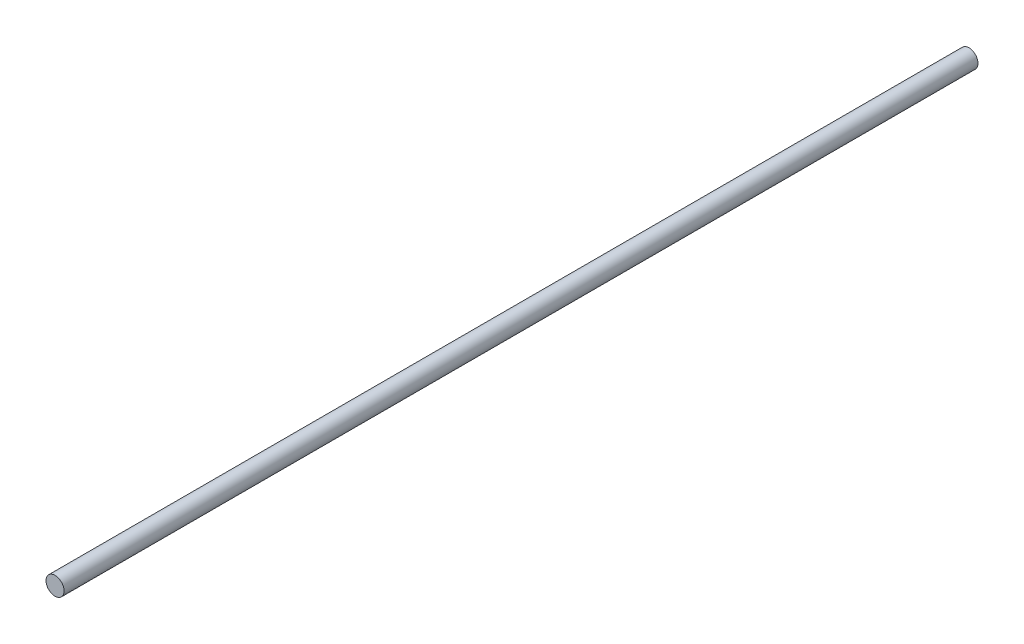
ISO-10303-21;
HEADER;
FILE_DESCRIPTION(('STEP AP214'),'2;1');
FILE_NAME('part.step','',(''),(''),'','','');
FILE_SCHEMA(('AUTOMOTIVE_DESIGN { 1 0 10303 214 1 1 1 1 }'));
ENDSEC;
DATA;
#1=APPLICATION_CONTEXT('core data for automotive mechanical design processes');
#2=APPLICATION_PROTOCOL_DEFINITION('international standard','automotive_design',2000,#1);
#3=PRODUCT_CONTEXT('',#1,'mechanical');
#4=PRODUCT('Part','Part','',(#3));
#5=PRODUCT_RELATED_PRODUCT_CATEGORY('part','',(#4));
#6=PRODUCT_DEFINITION_FORMATION('','',#4);
#7=PRODUCT_DEFINITION_CONTEXT('part definition',#1,'design');
#8=PRODUCT_DEFINITION('design','',#6,#7);
#9=PRODUCT_DEFINITION_SHAPE('','',#8);
#10=(LENGTH_UNIT() NAMED_UNIT(*) SI_UNIT(.MILLI.,.METRE.));
#11=(NAMED_UNIT(*) PLANE_ANGLE_UNIT() SI_UNIT($,.RADIAN.));
#12=(NAMED_UNIT(*) SI_UNIT($,.STERADIAN.) SOLID_ANGLE_UNIT());
#13=UNCERTAINTY_MEASURE_WITH_UNIT(LENGTH_MEASURE(1.E-05),#10,'distance_accuracy_value','');
#14=(GEOMETRIC_REPRESENTATION_CONTEXT(3) GLOBAL_UNCERTAINTY_ASSIGNED_CONTEXT((#13)) GLOBAL_UNIT_ASSIGNED_CONTEXT((#10,
#11,#12)) REPRESENTATION_CONTEXT('',''));
#15=CARTESIAN_POINT('',(0.,0.,0.));
#16=DIRECTION('',(0.,0.,1.));
#17=DIRECTION('',(1.,0.,0.));
#18=AXIS2_PLACEMENT_3D('',#15,#16,#17);
#19=CARTESIAN_POINT('',(0.,0.,605.8));
#20=DIRECTION('',(0.,0.,-1.));
#21=DIRECTION('',(-1.,0.,0.));
#22=AXIS2_PLACEMENT_3D('',#19,#20,#21);
#23=CYLINDRICAL_SURFACE('',#22,6.);
#24=CARTESIAN_POINT('',(0.,0.,605.8));
#25=DIRECTION('',(0.,0.,1.));
#26=DIRECTION('',(1.,0.,0.));
#27=AXIS2_PLACEMENT_3D('',#24,#25,#26);
#28=CIRCLE('',#27,6.);
#29=CARTESIAN_POINT('',(6.,0.,605.8));
#30=VERTEX_POINT('',#29);
#31=EDGE_CURVE('E10',#30,#30,#28,.T.);
#32=ORIENTED_EDGE('',*,*,#31,.F.);
#33=EDGE_LOOP('',(#32));
#34=FACE_BOUND('',#33,.T.);
#35=CARTESIAN_POINT('',(0.,0.,0.));
#36=DIRECTION('',(0.,0.,1.));
#37=DIRECTION('',(1.,0.,0.));
#38=AXIS2_PLACEMENT_3D('',#35,#36,#37);
#39=CIRCLE('',#38,6.);
#40=CARTESIAN_POINT('',(6.,0.,0.));
#41=VERTEX_POINT('',#40);
#42=EDGE_CURVE('E31',#41,#41,#39,.T.);
#43=ORIENTED_EDGE('',*,*,#42,.T.);
#44=EDGE_LOOP('',(#43));
#45=FACE_BOUND('',#44,.T.);
#46=ADVANCED_FACE('F28',(#34,#45),#23,.T.);
#47=CARTESIAN_POINT('',(0.,0.,605.8));
#48=DIRECTION('',(0.,0.,1.));
#49=DIRECTION('',(1.,0.,0.));
#50=AXIS2_PLACEMENT_3D('',#47,#48,#49);
#51=PLANE('',#50);
#52=ORIENTED_EDGE('',*,*,#31,.T.);
#53=EDGE_LOOP('',(#52));
#54=FACE_BOUND('',#53,.T.);
#55=ADVANCED_FACE('F43',(#54),#51,.T.);
#56=CARTESIAN_POINT('',(0.,0.,0.));
#57=DIRECTION('',(0.,0.,1.));
#58=DIRECTION('',(1.,0.,0.));
#59=AXIS2_PLACEMENT_3D('',#56,#57,#58);
#60=PLANE('',#59);
#61=ORIENTED_EDGE('',*,*,#42,.F.);
#62=EDGE_LOOP('',(#61));
#63=FACE_BOUND('',#62,.T.);
#64=ADVANCED_FACE('F41',(#63),#60,.F.);
#65=CLOSED_SHELL('',(#46,#55,#64));
#66=MANIFOLD_SOLID_BREP('B2',#65);
#67=ADVANCED_BREP_SHAPE_REPRESENTATION('',(#18,#66),#14);
#68=SHAPE_DEFINITION_REPRESENTATION(#9,#67);
ENDSEC;
END-ISO-10303-21;
